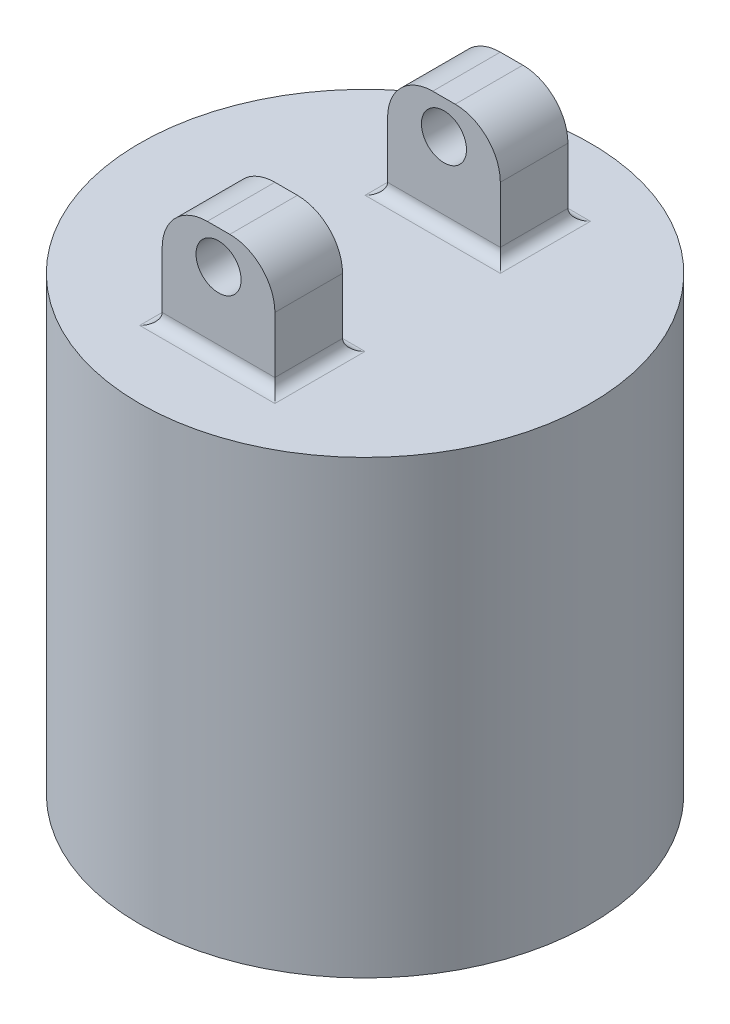
ISO-10303-21;
HEADER;
FILE_DESCRIPTION(('STEP AP214'),'2;1');
FILE_NAME('part.step','',(''),(''),'','','');
FILE_SCHEMA(('AUTOMOTIVE_DESIGN { 1 0 10303 214 1 1 1 1 }'));
ENDSEC;
DATA;
#1=APPLICATION_CONTEXT('core data for automotive mechanical design processes');
#2=APPLICATION_PROTOCOL_DEFINITION('international standard','automotive_design',2000,#1);
#3=PRODUCT_CONTEXT('',#1,'mechanical');
#4=PRODUCT('Part','Part','',(#3));
#5=PRODUCT_RELATED_PRODUCT_CATEGORY('part','',(#4));
#6=PRODUCT_DEFINITION_FORMATION('','',#4);
#7=PRODUCT_DEFINITION_CONTEXT('part definition',#1,'design');
#8=PRODUCT_DEFINITION('design','',#6,#7);
#9=PRODUCT_DEFINITION_SHAPE('','',#8);
#10=(LENGTH_UNIT() NAMED_UNIT(*) SI_UNIT(.MILLI.,.METRE.));
#11=(NAMED_UNIT(*) PLANE_ANGLE_UNIT() SI_UNIT($,.RADIAN.));
#12=(NAMED_UNIT(*) SI_UNIT($,.STERADIAN.) SOLID_ANGLE_UNIT());
#13=UNCERTAINTY_MEASURE_WITH_UNIT(LENGTH_MEASURE(1.E-05),#10,'distance_accuracy_value','');
#14=(GEOMETRIC_REPRESENTATION_CONTEXT(3) GLOBAL_UNCERTAINTY_ASSIGNED_CONTEXT((#13)) GLOBAL_UNIT_ASSIGNED_CONTEXT((#10,
#11,#12)) REPRESENTATION_CONTEXT('',''));
#15=CARTESIAN_POINT('',(0.,0.,0.));
#16=DIRECTION('',(0.,0.,1.));
#17=DIRECTION('',(1.,0.,0.));
#18=AXIS2_PLACEMENT_3D('',#15,#16,#17);
#19=CARTESIAN_POINT('',(0.,100.,0.));
#20=DIRECTION('',(0.,1.,0.));
#21=DIRECTION('',(0.,0.,1.));
#22=AXIS2_PLACEMENT_3D('',#19,#20,#21);
#23=PLANE('',#22);
#24=DIRECTION('',(0.,0.,-1.));
#25=VECTOR('',#24,1.);
#26=CARTESIAN_POINT('',(15.,100.,0.));
#27=LINE('',#26,#25);
#28=CARTESIAN_POINT('',(15.,100.,-35.));
#29=VERTEX_POINT('',#28);
#30=CARTESIAN_POINT('',(15.,100.,-15.));
#31=VERTEX_POINT('',#30);
#32=EDGE_CURVE('E231',#29,#31,#27,.F.);
#33=ORIENTED_EDGE('',*,*,#32,.T.);
#34=DIRECTION('',(1.,0.,0.));
#35=VECTOR('',#34,1.);
#36=CARTESIAN_POINT('',(0.,100.,-15.));
#37=LINE('',#36,#35);
#38=CARTESIAN_POINT('',(-15.,100.,-15.));
#39=VERTEX_POINT('',#38);
#40=EDGE_CURVE('E233',#31,#39,#37,.F.);
#41=ORIENTED_EDGE('',*,*,#40,.T.);
#42=DIRECTION('',(0.,0.,1.));
#43=VECTOR('',#42,1.);
#44=CARTESIAN_POINT('',(-15.,100.,0.));
#45=LINE('',#44,#43);
#46=CARTESIAN_POINT('',(-15.,100.,-35.));
#47=VERTEX_POINT('',#46);
#48=EDGE_CURVE('E227',#39,#47,#45,.F.);
#49=ORIENTED_EDGE('',*,*,#48,.T.);
#50=DIRECTION('',(-1.,0.,0.));
#51=VECTOR('',#50,1.);
#52=CARTESIAN_POINT('',(0.,100.,-35.));
#53=LINE('',#52,#51);
#54=EDGE_CURVE('E229',#47,#29,#53,.F.);
#55=ORIENTED_EDGE('',*,*,#54,.T.);
#56=EDGE_LOOP('',(#33,#41,#49,#55));
#57=FACE_BOUND('',#56,.T.);
#58=DIRECTION('',(0.,0.,1.));
#59=VECTOR('',#58,1.);
#60=CARTESIAN_POINT('',(-15.,100.,0.));
#61=LINE('',#60,#59);
#62=CARTESIAN_POINT('',(-15.,100.,35.));
#63=VERTEX_POINT('',#62);
#64=CARTESIAN_POINT('',(-15.,100.,15.));
#65=VERTEX_POINT('',#64);
#66=EDGE_CURVE('E194',#63,#65,#61,.F.);
#67=ORIENTED_EDGE('',*,*,#66,.T.);
#68=DIRECTION('',(-1.,0.,0.));
#69=VECTOR('',#68,1.);
#70=CARTESIAN_POINT('',(0.,100.,15.));
#71=LINE('',#70,#69);
#72=CARTESIAN_POINT('',(15.,100.,15.));
#73=VERTEX_POINT('',#72);
#74=EDGE_CURVE('E168',#65,#73,#71,.F.);
#75=ORIENTED_EDGE('',*,*,#74,.T.);
#76=DIRECTION('',(0.,0.,-1.));
#77=VECTOR('',#76,1.);
#78=CARTESIAN_POINT('',(15.,100.,0.));
#79=LINE('',#78,#77);
#80=CARTESIAN_POINT('',(15.,100.,35.));
#81=VERTEX_POINT('',#80);
#82=EDGE_CURVE('E183',#73,#81,#79,.F.);
#83=ORIENTED_EDGE('',*,*,#82,.T.);
#84=DIRECTION('',(1.,0.,0.));
#85=VECTOR('',#84,1.);
#86=CARTESIAN_POINT('',(0.,100.,35.));
#87=LINE('',#86,#85);
#88=EDGE_CURVE('E186',#81,#63,#87,.F.);
#89=ORIENTED_EDGE('',*,*,#88,.T.);
#90=EDGE_LOOP('',(#67,#75,#83,#89));
#91=FACE_BOUND('',#90,.T.);
#92=CARTESIAN_POINT('',(0.,100.,0.));
#93=DIRECTION('',(0.,1.,0.));
#94=DIRECTION('',(0.,0.,1.));
#95=AXIS2_PLACEMENT_3D('',#92,#93,#94);
#96=CIRCLE('',#95,50.);
#97=CARTESIAN_POINT('',(0.,100.,50.));
#98=VERTEX_POINT('',#97);
#99=EDGE_CURVE('E184',#98,#98,#96,.T.);
#100=ORIENTED_EDGE('',*,*,#99,.T.);
#101=EDGE_LOOP('',(#100));
#102=FACE_BOUND('',#101,.T.);
#103=ADVANCED_FACE('F32',(#57,#91,#102),#23,.T.);
#104=CARTESIAN_POINT('',(0.,100.,0.));
#105=DIRECTION('',(0.,-1.,0.));
#106=DIRECTION('',(0.,0.,-1.));
#107=AXIS2_PLACEMENT_3D('',#104,#105,#106);
#108=CYLINDRICAL_SURFACE('',#107,50.);
#109=ORIENTED_EDGE('',*,*,#99,.F.);
#110=EDGE_LOOP('',(#109));
#111=FACE_BOUND('',#110,.T.);
#112=CARTESIAN_POINT('',(0.,0.,0.));
#113=DIRECTION('',(0.,1.,0.));
#114=DIRECTION('',(0.,0.,1.));
#115=AXIS2_PLACEMENT_3D('',#112,#113,#114);
#116=CIRCLE('',#115,50.);
#117=CARTESIAN_POINT('',(0.,0.,50.));
#118=VERTEX_POINT('',#117);
#119=EDGE_CURVE('E189',#118,#118,#116,.T.);
#120=ORIENTED_EDGE('',*,*,#119,.T.);
#121=EDGE_LOOP('',(#120));
#122=FACE_BOUND('',#121,.T.);
#123=ADVANCED_FACE('F313',(#111,#122),#108,.T.);
#124=CARTESIAN_POINT('',(0.,0.,0.));
#125=DIRECTION('',(0.,1.,0.));
#126=DIRECTION('',(0.,0.,1.));
#127=AXIS2_PLACEMENT_3D('',#124,#125,#126);
#128=PLANE('',#127);
#129=ORIENTED_EDGE('',*,*,#119,.F.);
#130=EDGE_LOOP('',(#129));
#131=FACE_BOUND('',#130,.T.);
#132=ADVANCED_FACE('F315',(#131),#128,.F.);
#133=CARTESIAN_POINT('',(12.5,125.,17.5));
#134=DIRECTION('',(-1.,0.,0.));
#135=DIRECTION('',(0.,0.,1.));
#136=AXIS2_PLACEMENT_3D('',#133,#134,#135);
#137=PLANE('',#136);
#138=DIRECTION('',(0.,-1.,0.));
#139=VECTOR('',#138,1.);
#140=CARTESIAN_POINT('',(12.5,125.,17.5));
#141=LINE('',#140,#139);
#142=CARTESIAN_POINT('',(12.5,115.,17.5));
#143=VERTEX_POINT('',#142);
#144=CARTESIAN_POINT('',(12.5,102.5,17.5));
#145=VERTEX_POINT('',#144);
#146=EDGE_CURVE('E157',#143,#145,#141,.T.);
#147=ORIENTED_EDGE('',*,*,#146,.F.);
#148=DIRECTION('',(0.,0.,-1.));
#149=VECTOR('',#148,1.);
#150=CARTESIAN_POINT('',(12.5,115.,32.5));
#151=LINE('',#150,#149);
#152=CARTESIAN_POINT('',(12.5,115.,32.5));
#153=VERTEX_POINT('',#152);
#154=EDGE_CURVE('E222',#143,#153,#151,.F.);
#155=ORIENTED_EDGE('',*,*,#154,.T.);
#156=DIRECTION('',(0.,-1.,0.));
#157=VECTOR('',#156,1.);
#158=CARTESIAN_POINT('',(12.5,125.,32.5));
#159=LINE('',#158,#157);
#160=CARTESIAN_POINT('',(12.5,102.5,32.5));
#161=VERTEX_POINT('',#160);
#162=EDGE_CURVE('E307',#153,#161,#159,.T.);
#163=ORIENTED_EDGE('',*,*,#162,.T.);
#164=DIRECTION('',(0.,0.,-1.));
#165=VECTOR('',#164,1.);
#166=CARTESIAN_POINT('',(12.5,102.5,17.5));
#167=LINE('',#166,#165);
#168=EDGE_CURVE('E199',#161,#145,#167,.T.);
#169=ORIENTED_EDGE('',*,*,#168,.T.);
#170=EDGE_LOOP('',(#147,#155,#163,#169));
#171=FACE_BOUND('',#170,.T.);
#172=ADVANCED_FACE('F317',(#171),#137,.F.);
#173=CARTESIAN_POINT('',(-12.5,125.,17.5));
#174=DIRECTION('',(0.,0.,1.));
#175=DIRECTION('',(1.,0.,0.));
#176=AXIS2_PLACEMENT_3D('',#173,#174,#175);
#177=PLANE('',#176);
#178=CARTESIAN_POINT('',(0.,117.5,17.5));
#179=DIRECTION('',(0.,0.,1.));
#180=DIRECTION('',(1.,0.,0.));
#181=AXIS2_PLACEMENT_3D('',#178,#179,#180);
#182=CIRCLE('',#181,5.00000000000001);
#183=CARTESIAN_POINT('',(5.,117.5,17.5));
#184=VERTEX_POINT('',#183);
#185=EDGE_CURVE('E172',#184,#184,#182,.T.);
#186=ORIENTED_EDGE('',*,*,#185,.T.);
#187=EDGE_LOOP('',(#186));
#188=FACE_BOUND('',#187,.T.);
#189=DIRECTION('',(0.,-1.,0.));
#190=VECTOR('',#189,1.);
#191=CARTESIAN_POINT('',(-12.5,125.,17.5));
#192=LINE('',#191,#190);
#193=CARTESIAN_POINT('',(-12.5,115.,17.5));
#194=VERTEX_POINT('',#193);
#195=CARTESIAN_POINT('',(-12.5,102.5,17.5));
#196=VERTEX_POINT('',#195);
#197=EDGE_CURVE('E145',#194,#196,#192,.T.);
#198=ORIENTED_EDGE('',*,*,#197,.F.);
#199=CARTESIAN_POINT('',(-2.50000000000001,115.,17.5));
#200=DIRECTION('',(0.,0.,1.));
#201=DIRECTION('',(1.,0.,0.));
#202=AXIS2_PLACEMENT_3D('',#199,#200,#201);
#203=CIRCLE('',#202,10.);
#204=CARTESIAN_POINT('',(-2.50000000000001,125.,17.5));
#205=VERTEX_POINT('',#204);
#206=EDGE_CURVE('E220',#194,#205,#203,.F.);
#207=ORIENTED_EDGE('',*,*,#206,.T.);
#208=DIRECTION('',(-1.,0.,0.));
#209=VECTOR('',#208,1.);
#210=CARTESIAN_POINT('',(-12.5,125.,17.5));
#211=LINE('',#210,#209);
#212=CARTESIAN_POINT('',(2.49999999999999,125.,17.5));
#213=VERTEX_POINT('',#212);
#214=EDGE_CURVE('E207',#213,#205,#211,.T.);
#215=ORIENTED_EDGE('',*,*,#214,.F.);
#216=CARTESIAN_POINT('',(2.49999999999999,115.,17.5));
#217=DIRECTION('',(0.,0.,1.));
#218=DIRECTION('',(1.,0.,0.));
#219=AXIS2_PLACEMENT_3D('',#216,#217,#218);
#220=CIRCLE('',#219,10.);
#221=EDGE_CURVE('E218',#213,#143,#220,.F.);
#222=ORIENTED_EDGE('',*,*,#221,.T.);
#223=ORIENTED_EDGE('',*,*,#146,.T.);
#224=DIRECTION('',(-1.,0.,0.));
#225=VECTOR('',#224,1.);
#226=CARTESIAN_POINT('',(-12.5,102.5,17.5));
#227=LINE('',#226,#225);
#228=EDGE_CURVE('E166',#145,#196,#227,.T.);
#229=ORIENTED_EDGE('',*,*,#228,.T.);
#230=EDGE_LOOP('',(#198,#207,#215,#222,#223,#229));
#231=FACE_BOUND('',#230,.T.);
#232=ADVANCED_FACE('F180',(#188,#231),#177,.F.);
#233=CARTESIAN_POINT('',(-12.5,125.,17.5));
#234=DIRECTION('',(1.,0.,0.));
#235=DIRECTION('',(0.,0.,-1.));
#236=AXIS2_PLACEMENT_3D('',#233,#234,#235);
#237=PLANE('',#236);
#238=DIRECTION('',(0.,-1.,0.));
#239=VECTOR('',#238,1.);
#240=CARTESIAN_POINT('',(-12.5,125.,32.5));
#241=LINE('',#240,#239);
#242=CARTESIAN_POINT('',(-12.5,115.,32.5));
#243=VERTEX_POINT('',#242);
#244=CARTESIAN_POINT('',(-12.5,102.5,32.5));
#245=VERTEX_POINT('',#244);
#246=EDGE_CURVE('E158',#243,#245,#241,.T.);
#247=ORIENTED_EDGE('',*,*,#246,.F.);
#248=DIRECTION('',(0.,0.,1.));
#249=VECTOR('',#248,1.);
#250=CARTESIAN_POINT('',(-12.5,115.,17.5));
#251=LINE('',#250,#249);
#252=EDGE_CURVE('E153',#243,#194,#251,.F.);
#253=ORIENTED_EDGE('',*,*,#252,.T.);
#254=ORIENTED_EDGE('',*,*,#197,.T.);
#255=DIRECTION('',(0.,0.,1.));
#256=VECTOR('',#255,1.);
#257=CARTESIAN_POINT('',(-12.5,102.5,17.5));
#258=LINE('',#257,#256);
#259=EDGE_CURVE('E150',#196,#245,#258,.T.);
#260=ORIENTED_EDGE('',*,*,#259,.T.);
#261=EDGE_LOOP('',(#247,#253,#254,#260));
#262=FACE_BOUND('',#261,.T.);
#263=ADVANCED_FACE('F148',(#262),#237,.F.);
#264=CARTESIAN_POINT('',(-12.5,125.,32.5));
#265=DIRECTION('',(0.,0.,-1.));
#266=DIRECTION('',(-1.,0.,0.));
#267=AXIS2_PLACEMENT_3D('',#264,#265,#266);
#268=PLANE('',#267);
#269=CARTESIAN_POINT('',(0.,117.5,32.5));
#270=DIRECTION('',(0.,0.,1.));
#271=DIRECTION('',(1.,0.,0.));
#272=AXIS2_PLACEMENT_3D('',#269,#270,#271);
#273=CIRCLE('',#272,5.00000000000001);
#274=CARTESIAN_POINT('',(5.,117.5,32.5));
#275=VERTEX_POINT('',#274);
#276=EDGE_CURVE('E297',#275,#275,#273,.T.);
#277=ORIENTED_EDGE('',*,*,#276,.F.);
#278=EDGE_LOOP('',(#277));
#279=FACE_BOUND('',#278,.T.);
#280=DIRECTION('',(1.,0.,0.));
#281=VECTOR('',#280,1.);
#282=CARTESIAN_POINT('',(-12.5,125.,32.5));
#283=LINE('',#282,#281);
#284=CARTESIAN_POINT('',(-2.5,125.,32.5));
#285=VERTEX_POINT('',#284);
#286=CARTESIAN_POINT('',(2.5,125.,32.5));
#287=VERTEX_POINT('',#286);
#288=EDGE_CURVE('E304',#285,#287,#283,.T.);
#289=ORIENTED_EDGE('',*,*,#288,.F.);
#290=CARTESIAN_POINT('',(-2.5,115.,32.5));
#291=DIRECTION('',(0.,0.,-1.));
#292=DIRECTION('',(-1.,0.,0.));
#293=AXIS2_PLACEMENT_3D('',#290,#291,#292);
#294=CIRCLE('',#293,10.);
#295=EDGE_CURVE('E215',#285,#243,#294,.F.);
#296=ORIENTED_EDGE('',*,*,#295,.T.);
#297=ORIENTED_EDGE('',*,*,#246,.T.);
#298=DIRECTION('',(1.,0.,0.));
#299=VECTOR('',#298,1.);
#300=CARTESIAN_POINT('',(-12.5,102.5,32.5));
#301=LINE('',#300,#299);
#302=EDGE_CURVE('E178',#245,#161,#301,.T.);
#303=ORIENTED_EDGE('',*,*,#302,.T.);
#304=ORIENTED_EDGE('',*,*,#162,.F.);
#305=CARTESIAN_POINT('',(2.5,115.,32.5));
#306=DIRECTION('',(0.,0.,-1.));
#307=DIRECTION('',(-1.,0.,0.));
#308=AXIS2_PLACEMENT_3D('',#305,#306,#307);
#309=CIRCLE('',#308,10.);
#310=EDGE_CURVE('E213',#153,#287,#309,.F.);
#311=ORIENTED_EDGE('',*,*,#310,.T.);
#312=EDGE_LOOP('',(#289,#296,#297,#303,#304,#311));
#313=FACE_BOUND('',#312,.T.);
#314=ADVANCED_FACE('F339',(#279,#313),#268,.F.);
#315=CARTESIAN_POINT('',(0.,125.,0.));
#316=DIRECTION('',(0.,1.,0.));
#317=DIRECTION('',(0.,0.,1.));
#318=AXIS2_PLACEMENT_3D('',#315,#316,#317);
#319=PLANE('',#318);
#320=ORIENTED_EDGE('',*,*,#214,.T.);
#321=DIRECTION('',(0.,0.,1.));
#322=VECTOR('',#321,1.);
#323=CARTESIAN_POINT('',(-2.5,125.,32.5));
#324=LINE('',#323,#322);
#325=EDGE_CURVE('E210',#205,#285,#324,.T.);
#326=ORIENTED_EDGE('',*,*,#325,.T.);
#327=ORIENTED_EDGE('',*,*,#288,.T.);
#328=DIRECTION('',(0.,0.,-1.));
#329=VECTOR('',#328,1.);
#330=CARTESIAN_POINT('',(2.49999999999999,125.,17.5));
#331=LINE('',#330,#329);
#332=EDGE_CURVE('E200',#287,#213,#331,.T.);
#333=ORIENTED_EDGE('',*,*,#332,.T.);
#334=EDGE_LOOP('',(#320,#326,#327,#333));
#335=FACE_BOUND('',#334,.T.);
#336=ADVANCED_FACE('F342',(#335),#319,.T.);
#337=CARTESIAN_POINT('',(-12.5,102.5,35.));
#338=DIRECTION('',(1.,0.,0.));
#339=DIRECTION('',(0.,0.,-1.));
#340=AXIS2_PLACEMENT_3D('',#337,#338,#339);
#341=CYLINDRICAL_SURFACE('',#340,2.5);
#342=CARTESIAN_POINT('',(-15.,102.5,35.));
#343=DIRECTION('',(0.707106781186548,0.,0.707106781186547));
#344=DIRECTION('',(0.707106781186547,0.,-0.707106781186548));
#345=AXIS2_PLACEMENT_3D('',#342,#343,#344);
#346=ELLIPSE('',#345,3.53553390593274,2.5);
#347=EDGE_CURVE('E177',#63,#245,#346,.T.);
#348=ORIENTED_EDGE('',*,*,#347,.F.);
#349=ORIENTED_EDGE('',*,*,#88,.F.);
#350=CARTESIAN_POINT('',(15.,102.5,35.));
#351=DIRECTION('',(0.707106781186547,0.,-0.707106781186548));
#352=DIRECTION('',(-0.707106781186548,0.,-0.707106781186547));
#353=AXIS2_PLACEMENT_3D('',#350,#351,#352);
#354=ELLIPSE('',#353,3.53553390593274,2.5);
#355=EDGE_CURVE('E204',#161,#81,#354,.F.);
#356=ORIENTED_EDGE('',*,*,#355,.F.);
#357=ORIENTED_EDGE('',*,*,#302,.F.);
#358=EDGE_LOOP('',(#348,#349,#356,#357));
#359=FACE_BOUND('',#358,.T.);
#360=ADVANCED_FACE('F346',(#359),#341,.F.);
#361=CARTESIAN_POINT('',(15.,102.5,17.5));
#362=DIRECTION('',(0.,0.,-1.));
#363=DIRECTION('',(-1.,0.,0.));
#364=AXIS2_PLACEMENT_3D('',#361,#362,#363);
#365=CYLINDRICAL_SURFACE('',#364,2.5);
#366=ORIENTED_EDGE('',*,*,#355,.T.);
#367=ORIENTED_EDGE('',*,*,#82,.F.);
#368=CARTESIAN_POINT('',(15.,102.5,15.));
#369=DIRECTION('',(-0.707106781186548,0.,-0.707106781186547));
#370=DIRECTION('',(0.707106781186547,0.,-0.707106781186548));
#371=AXIS2_PLACEMENT_3D('',#368,#369,#370);
#372=ELLIPSE('',#371,3.53553390593274,2.5);
#373=EDGE_CURVE('E171',#145,#73,#372,.F.);
#374=ORIENTED_EDGE('',*,*,#373,.F.);
#375=ORIENTED_EDGE('',*,*,#168,.F.);
#376=EDGE_LOOP('',(#366,#367,#374,#375));
#377=FACE_BOUND('',#376,.T.);
#378=ADVANCED_FACE('F518',(#377),#365,.F.);
#379=CARTESIAN_POINT('',(-15.,102.5,17.5));
#380=DIRECTION('',(0.,0.,1.));
#381=DIRECTION('',(1.,0.,0.));
#382=AXIS2_PLACEMENT_3D('',#379,#380,#381);
#383=CYLINDRICAL_SURFACE('',#382,2.5);
#384=ORIENTED_EDGE('',*,*,#347,.T.);
#385=ORIENTED_EDGE('',*,*,#259,.F.);
#386=CARTESIAN_POINT('',(-15.,102.5,15.));
#387=DIRECTION('',(-0.707106781186547,0.,0.707106781186548));
#388=DIRECTION('',(0.707106781186548,0.,0.707106781186547));
#389=AXIS2_PLACEMENT_3D('',#386,#387,#388);
#390=ELLIPSE('',#389,3.53553390593274,2.5);
#391=EDGE_CURVE('E164',#65,#196,#390,.T.);
#392=ORIENTED_EDGE('',*,*,#391,.F.);
#393=ORIENTED_EDGE('',*,*,#66,.F.);
#394=EDGE_LOOP('',(#384,#385,#392,#393));
#395=FACE_BOUND('',#394,.T.);
#396=ADVANCED_FACE('F175',(#395),#383,.F.);
#397=CARTESIAN_POINT('',(-12.5,102.5,15.));
#398=DIRECTION('',(-1.,0.,0.));
#399=DIRECTION('',(0.,0.,1.));
#400=AXIS2_PLACEMENT_3D('',#397,#398,#399);
#401=CYLINDRICAL_SURFACE('',#400,2.5);
#402=ORIENTED_EDGE('',*,*,#373,.T.);
#403=ORIENTED_EDGE('',*,*,#74,.F.);
#404=ORIENTED_EDGE('',*,*,#391,.T.);
#405=ORIENTED_EDGE('',*,*,#228,.F.);
#406=EDGE_LOOP('',(#402,#403,#404,#405));
#407=FACE_BOUND('',#406,.T.);
#408=ADVANCED_FACE('F165',(#407),#401,.F.);
#409=CARTESIAN_POINT('',(-2.50000000000002,115.,0.));
#410=DIRECTION('',(0.,0.,-1.));
#411=DIRECTION('',(-1.,0.,0.));
#412=AXIS2_PLACEMENT_3D('',#409,#410,#411);
#413=CYLINDRICAL_SURFACE('',#412,10.);
#414=ORIENTED_EDGE('',*,*,#206,.F.);
#415=ORIENTED_EDGE('',*,*,#252,.F.);
#416=ORIENTED_EDGE('',*,*,#295,.F.);
#417=ORIENTED_EDGE('',*,*,#325,.F.);
#418=EDGE_LOOP('',(#414,#415,#416,#417));
#419=FACE_BOUND('',#418,.T.);
#420=ADVANCED_FACE('F492',(#419),#413,.T.);
#421=CARTESIAN_POINT('',(2.49999999999999,115.,0.));
#422=DIRECTION('',(0.,0.,1.));
#423=DIRECTION('',(1.,0.,0.));
#424=AXIS2_PLACEMENT_3D('',#421,#422,#423);
#425=CYLINDRICAL_SURFACE('',#424,10.);
#426=ORIENTED_EDGE('',*,*,#310,.F.);
#427=ORIENTED_EDGE('',*,*,#154,.F.);
#428=ORIENTED_EDGE('',*,*,#221,.F.);
#429=ORIENTED_EDGE('',*,*,#332,.F.);
#430=EDGE_LOOP('',(#426,#427,#428,#429));
#431=FACE_BOUND('',#430,.T.);
#432=ADVANCED_FACE('F352',(#431),#425,.T.);
#433=CARTESIAN_POINT('',(0.,117.5,7.5));
#434=DIRECTION('',(0.,0.,1.));
#435=DIRECTION('',(1.,0.,0.));
#436=AXIS2_PLACEMENT_3D('',#433,#434,#435);
#437=CYLINDRICAL_SURFACE('',#436,5.00000000000001);
#438=ORIENTED_EDGE('',*,*,#276,.T.);
#439=EDGE_LOOP('',(#438));
#440=FACE_BOUND('',#439,.T.);
#441=ORIENTED_EDGE('',*,*,#185,.F.);
#442=EDGE_LOOP('',(#441));
#443=FACE_BOUND('',#442,.T.);
#444=ADVANCED_FACE('F348',(#440,#443),#437,.F.);
#445=CARTESIAN_POINT('',(-12.5,125.,-17.5));
#446=DIRECTION('',(1.,0.,0.));
#447=DIRECTION('',(0.,0.,-1.));
#448=AXIS2_PLACEMENT_3D('',#445,#446,#447);
#449=PLANE('',#448);
#450=DIRECTION('',(0.,-1.,0.));
#451=VECTOR('',#450,1.);
#452=CARTESIAN_POINT('',(-12.5,125.,-17.5));
#453=LINE('',#452,#451);
#454=CARTESIAN_POINT('',(-12.5,115.,-17.5));
#455=VERTEX_POINT('',#454);
#456=CARTESIAN_POINT('',(-12.5,102.5,-17.5));
#457=VERTEX_POINT('',#456);
#458=EDGE_CURVE('E291',#455,#457,#453,.T.);
#459=ORIENTED_EDGE('',*,*,#458,.F.);
#460=DIRECTION('',(0.,0.,1.));
#461=VECTOR('',#460,1.);
#462=CARTESIAN_POINT('',(-12.5,115.,-32.5));
#463=LINE('',#462,#461);
#464=CARTESIAN_POINT('',(-12.5,115.,-32.5));
#465=VERTEX_POINT('',#464);
#466=EDGE_CURVE('E11',#455,#465,#463,.F.);
#467=ORIENTED_EDGE('',*,*,#466,.T.);
#468=DIRECTION('',(0.,-1.,0.));
#469=VECTOR('',#468,1.);
#470=CARTESIAN_POINT('',(-12.5,125.,-32.5));
#471=LINE('',#470,#469);
#472=CARTESIAN_POINT('',(-12.5,102.5,-32.5));
#473=VERTEX_POINT('',#472);
#474=EDGE_CURVE('E289',#465,#473,#471,.T.);
#475=ORIENTED_EDGE('',*,*,#474,.T.);
#476=DIRECTION('',(0.,0.,1.));
#477=VECTOR('',#476,1.);
#478=CARTESIAN_POINT('',(-12.5,102.5,-17.5));
#479=LINE('',#478,#477);
#480=EDGE_CURVE('E242',#473,#457,#479,.T.);
#481=ORIENTED_EDGE('',*,*,#480,.T.);
#482=EDGE_LOOP('',(#459,#467,#475,#481));
#483=FACE_BOUND('',#482,.T.);
#484=ADVANCED_FACE('F351',(#483),#449,.F.);
#485=CARTESIAN_POINT('',(12.5,125.,-17.5));
#486=DIRECTION('',(0.,0.,-1.));
#487=DIRECTION('',(-1.,0.,0.));
#488=AXIS2_PLACEMENT_3D('',#485,#486,#487);
#489=PLANE('',#488);
#490=CARTESIAN_POINT('',(0.,117.5,-17.5));
#491=DIRECTION('',(0.,0.,-1.));
#492=DIRECTION('',(-1.,0.,0.));
#493=AXIS2_PLACEMENT_3D('',#490,#491,#492);
#494=CIRCLE('',#493,5.00000000000001);
#495=CARTESIAN_POINT('',(-5.,117.5,-17.5));
#496=VERTEX_POINT('',#495);
#497=EDGE_CURVE('E250',#496,#496,#494,.T.);
#498=ORIENTED_EDGE('',*,*,#497,.T.);
#499=EDGE_LOOP('',(#498));
#500=FACE_BOUND('',#499,.T.);
#501=DIRECTION('',(0.,-1.,0.));
#502=VECTOR('',#501,1.);
#503=CARTESIAN_POINT('',(12.5,125.,-17.5));
#504=LINE('',#503,#502);
#505=CARTESIAN_POINT('',(12.5,115.,-17.5));
#506=VERTEX_POINT('',#505);
#507=CARTESIAN_POINT('',(12.5,102.5,-17.5));
#508=VERTEX_POINT('',#507);
#509=EDGE_CURVE('E272',#506,#508,#504,.T.);
#510=ORIENTED_EDGE('',*,*,#509,.F.);
#511=CARTESIAN_POINT('',(2.50000000000001,115.,-17.5));
#512=DIRECTION('',(0.,0.,-1.));
#513=DIRECTION('',(-1.,0.,0.));
#514=AXIS2_PLACEMENT_3D('',#511,#512,#513);
#515=CIRCLE('',#514,10.);
#516=CARTESIAN_POINT('',(2.50000000000001,125.,-17.5));
#517=VERTEX_POINT('',#516);
#518=EDGE_CURVE('E40',#506,#517,#515,.F.);
#519=ORIENTED_EDGE('',*,*,#518,.T.);
#520=DIRECTION('',(1.,0.,0.));
#521=VECTOR('',#520,1.);
#522=CARTESIAN_POINT('',(12.5,125.,-17.5));
#523=LINE('',#522,#521);
#524=CARTESIAN_POINT('',(-2.49999999999999,125.,-17.5));
#525=VERTEX_POINT('',#524);
#526=EDGE_CURVE('E258',#525,#517,#523,.T.);
#527=ORIENTED_EDGE('',*,*,#526,.F.);
#528=CARTESIAN_POINT('',(-2.49999999999999,115.,-17.5));
#529=DIRECTION('',(0.,0.,-1.));
#530=DIRECTION('',(-1.,0.,0.));
#531=AXIS2_PLACEMENT_3D('',#528,#529,#530);
#532=CIRCLE('',#531,10.);
#533=EDGE_CURVE('E47',#525,#455,#532,.F.);
#534=ORIENTED_EDGE('',*,*,#533,.T.);
#535=ORIENTED_EDGE('',*,*,#458,.T.);
#536=DIRECTION('',(1.,0.,0.));
#537=VECTOR('',#536,1.);
#538=CARTESIAN_POINT('',(12.5,102.5,-17.5));
#539=LINE('',#538,#537);
#540=EDGE_CURVE('E224',#457,#508,#539,.T.);
#541=ORIENTED_EDGE('',*,*,#540,.T.);
#542=EDGE_LOOP('',(#510,#519,#527,#534,#535,#541));
#543=FACE_BOUND('',#542,.T.);
#544=ADVANCED_FACE('F271',(#500,#543),#489,.F.);
#545=CARTESIAN_POINT('',(12.5,125.,-17.5));
#546=DIRECTION('',(-1.,0.,0.));
#547=DIRECTION('',(0.,0.,1.));
#548=AXIS2_PLACEMENT_3D('',#545,#546,#547);
#549=PLANE('',#548);
#550=DIRECTION('',(0.,-1.,0.));
#551=VECTOR('',#550,1.);
#552=CARTESIAN_POINT('',(12.5,125.,-32.5));
#553=LINE('',#552,#551);
#554=CARTESIAN_POINT('',(12.5,115.,-32.5));
#555=VERTEX_POINT('',#554);
#556=CARTESIAN_POINT('',(12.5,102.5,-32.5));
#557=VERTEX_POINT('',#556);
#558=EDGE_CURVE('E285',#555,#557,#553,.T.);
#559=ORIENTED_EDGE('',*,*,#558,.F.);
#560=DIRECTION('',(0.,0.,-1.));
#561=VECTOR('',#560,1.);
#562=CARTESIAN_POINT('',(12.5,115.,-17.5));
#563=LINE('',#562,#561);
#564=EDGE_CURVE('E55',#555,#506,#563,.F.);
#565=ORIENTED_EDGE('',*,*,#564,.T.);
#566=ORIENTED_EDGE('',*,*,#509,.T.);
#567=DIRECTION('',(0.,0.,-1.));
#568=VECTOR('',#567,1.);
#569=CARTESIAN_POINT('',(12.5,102.5,-17.5));
#570=LINE('',#569,#568);
#571=EDGE_CURVE('E236',#508,#557,#570,.T.);
#572=ORIENTED_EDGE('',*,*,#571,.T.);
#573=EDGE_LOOP('',(#559,#565,#566,#572));
#574=FACE_BOUND('',#573,.T.);
#575=ADVANCED_FACE('F286',(#574),#549,.F.);
#576=CARTESIAN_POINT('',(12.5,125.,-32.5));
#577=DIRECTION('',(0.,0.,1.));
#578=DIRECTION('',(1.,0.,0.));
#579=AXIS2_PLACEMENT_3D('',#576,#577,#578);
#580=PLANE('',#579);
#581=CARTESIAN_POINT('',(0.,117.5,-32.5));
#582=DIRECTION('',(0.,0.,-1.));
#583=DIRECTION('',(-1.,0.,0.));
#584=AXIS2_PLACEMENT_3D('',#581,#582,#583);
#585=CIRCLE('',#584,5.00000000000001);
#586=CARTESIAN_POINT('',(-5.,117.5,-32.5));
#587=VERTEX_POINT('',#586);
#588=EDGE_CURVE('E378',#587,#587,#585,.T.);
#589=ORIENTED_EDGE('',*,*,#588,.F.);
#590=EDGE_LOOP('',(#589));
#591=FACE_BOUND('',#590,.T.);
#592=DIRECTION('',(-1.,0.,0.));
#593=VECTOR('',#592,1.);
#594=CARTESIAN_POINT('',(12.5,125.,-32.5));
#595=LINE('',#594,#593);
#596=CARTESIAN_POINT('',(2.5,125.,-32.5));
#597=VERTEX_POINT('',#596);
#598=CARTESIAN_POINT('',(-2.5,125.,-32.5));
#599=VERTEX_POINT('',#598);
#600=EDGE_CURVE('E280',#597,#599,#595,.T.);
#601=ORIENTED_EDGE('',*,*,#600,.F.);
#602=CARTESIAN_POINT('',(2.5,115.,-32.5));
#603=DIRECTION('',(0.,0.,1.));
#604=DIRECTION('',(1.,0.,0.));
#605=AXIS2_PLACEMENT_3D('',#602,#603,#604);
#606=CIRCLE('',#605,10.);
#607=EDGE_CURVE('E266',#597,#555,#606,.F.);
#608=ORIENTED_EDGE('',*,*,#607,.T.);
#609=ORIENTED_EDGE('',*,*,#558,.T.);
#610=DIRECTION('',(-1.,0.,0.));
#611=VECTOR('',#610,1.);
#612=CARTESIAN_POINT('',(12.5,102.5,-32.5));
#613=LINE('',#612,#611);
#614=EDGE_CURVE('E239',#557,#473,#613,.T.);
#615=ORIENTED_EDGE('',*,*,#614,.T.);
#616=ORIENTED_EDGE('',*,*,#474,.F.);
#617=CARTESIAN_POINT('',(-2.5,115.,-32.5));
#618=DIRECTION('',(0.,0.,1.));
#619=DIRECTION('',(1.,0.,0.));
#620=AXIS2_PLACEMENT_3D('',#617,#618,#619);
#621=CIRCLE('',#620,10.);
#622=EDGE_CURVE('E264',#465,#599,#621,.F.);
#623=ORIENTED_EDGE('',*,*,#622,.T.);
#624=EDGE_LOOP('',(#601,#608,#609,#615,#616,#623));
#625=FACE_BOUND('',#624,.T.);
#626=ADVANCED_FACE('F284',(#591,#625),#580,.F.);
#627=CARTESIAN_POINT('',(0.,125.,0.));
#628=DIRECTION('',(0.,1.,0.));
#629=DIRECTION('',(0.,0.,-1.));
#630=AXIS2_PLACEMENT_3D('',#627,#628,#629);
#631=PLANE('',#630);
#632=ORIENTED_EDGE('',*,*,#526,.T.);
#633=DIRECTION('',(0.,0.,-1.));
#634=VECTOR('',#633,1.);
#635=CARTESIAN_POINT('',(2.5,125.,-32.5));
#636=LINE('',#635,#634);
#637=EDGE_CURVE('E261',#517,#597,#636,.T.);
#638=ORIENTED_EDGE('',*,*,#637,.T.);
#639=ORIENTED_EDGE('',*,*,#600,.T.);
#640=DIRECTION('',(0.,0.,1.));
#641=VECTOR('',#640,1.);
#642=CARTESIAN_POINT('',(-2.49999999999999,125.,-17.5));
#643=LINE('',#642,#641);
#644=EDGE_CURVE('E245',#599,#525,#643,.T.);
#645=ORIENTED_EDGE('',*,*,#644,.T.);
#646=EDGE_LOOP('',(#632,#638,#639,#645));
#647=FACE_BOUND('',#646,.T.);
#648=ADVANCED_FACE('F276',(#647),#631,.T.);
#649=CARTESIAN_POINT('',(12.5,102.5,-35.));
#650=DIRECTION('',(-1.,0.,0.));
#651=DIRECTION('',(0.,0.,1.));
#652=AXIS2_PLACEMENT_3D('',#649,#650,#651);
#653=CYLINDRICAL_SURFACE('',#652,2.5);
#654=CARTESIAN_POINT('',(15.,102.5,-35.));
#655=DIRECTION('',(-0.707106781186548,0.,-0.707106781186547));
#656=DIRECTION('',(-0.707106781186547,0.,0.707106781186548));
#657=AXIS2_PLACEMENT_3D('',#654,#655,#656);
#658=ELLIPSE('',#657,3.53553390593274,2.5);
#659=EDGE_CURVE('E252',#29,#557,#658,.T.);
#660=ORIENTED_EDGE('',*,*,#659,.F.);
#661=ORIENTED_EDGE('',*,*,#54,.F.);
#662=CARTESIAN_POINT('',(-15.,102.5,-35.));
#663=DIRECTION('',(-0.707106781186547,0.,0.707106781186548));
#664=DIRECTION('',(0.707106781186548,0.,0.707106781186547));
#665=AXIS2_PLACEMENT_3D('',#662,#663,#664);
#666=ELLIPSE('',#665,3.53553390593274,2.5);
#667=EDGE_CURVE('E255',#473,#47,#666,.F.);
#668=ORIENTED_EDGE('',*,*,#667,.F.);
#669=ORIENTED_EDGE('',*,*,#614,.F.);
#670=EDGE_LOOP('',(#660,#661,#668,#669));
#671=FACE_BOUND('',#670,.T.);
#672=ADVANCED_FACE('F367',(#671),#653,.F.);
#673=CARTESIAN_POINT('',(-15.,102.5,-17.5));
#674=DIRECTION('',(0.,0.,1.));
#675=DIRECTION('',(1.,0.,0.));
#676=AXIS2_PLACEMENT_3D('',#673,#674,#675);
#677=CYLINDRICAL_SURFACE('',#676,2.5);
#678=ORIENTED_EDGE('',*,*,#667,.T.);
#679=ORIENTED_EDGE('',*,*,#48,.F.);
#680=CARTESIAN_POINT('',(-15.,102.5,-15.));
#681=DIRECTION('',(0.707106781186548,0.,0.707106781186547));
#682=DIRECTION('',(-0.707106781186547,0.,0.707106781186548));
#683=AXIS2_PLACEMENT_3D('',#680,#681,#682);
#684=ELLIPSE('',#683,3.53553390593274,2.5);
#685=EDGE_CURVE('E249',#457,#39,#684,.F.);
#686=ORIENTED_EDGE('',*,*,#685,.F.);
#687=ORIENTED_EDGE('',*,*,#480,.F.);
#688=EDGE_LOOP('',(#678,#679,#686,#687));
#689=FACE_BOUND('',#688,.T.);
#690=ADVANCED_FACE('F394',(#689),#677,.F.);
#691=CARTESIAN_POINT('',(15.,102.5,-17.5));
#692=DIRECTION('',(0.,0.,-1.));
#693=DIRECTION('',(-1.,0.,0.));
#694=AXIS2_PLACEMENT_3D('',#691,#692,#693);
#695=CYLINDRICAL_SURFACE('',#694,2.5);
#696=ORIENTED_EDGE('',*,*,#659,.T.);
#697=ORIENTED_EDGE('',*,*,#571,.F.);
#698=CARTESIAN_POINT('',(15.,102.5,-15.));
#699=DIRECTION('',(0.707106781186547,0.,-0.707106781186548));
#700=DIRECTION('',(-0.707106781186548,0.,-0.707106781186547));
#701=AXIS2_PLACEMENT_3D('',#698,#699,#700);
#702=ELLIPSE('',#701,3.53553390593274,2.5);
#703=EDGE_CURVE('E246',#31,#508,#702,.T.);
#704=ORIENTED_EDGE('',*,*,#703,.F.);
#705=ORIENTED_EDGE('',*,*,#32,.F.);
#706=EDGE_LOOP('',(#696,#697,#704,#705));
#707=FACE_BOUND('',#706,.T.);
#708=ADVANCED_FACE('F402',(#707),#695,.F.);
#709=CARTESIAN_POINT('',(12.5,102.5,-15.));
#710=DIRECTION('',(1.,0.,0.));
#711=DIRECTION('',(0.,0.,-1.));
#712=AXIS2_PLACEMENT_3D('',#709,#710,#711);
#713=CYLINDRICAL_SURFACE('',#712,2.5);
#714=ORIENTED_EDGE('',*,*,#685,.T.);
#715=ORIENTED_EDGE('',*,*,#40,.F.);
#716=ORIENTED_EDGE('',*,*,#703,.T.);
#717=ORIENTED_EDGE('',*,*,#540,.F.);
#718=EDGE_LOOP('',(#714,#715,#716,#717));
#719=FACE_BOUND('',#718,.T.);
#720=ADVANCED_FACE('F398',(#719),#713,.F.);
#721=CARTESIAN_POINT('',(2.50000000000002,115.,0.));
#722=DIRECTION('',(0.,0.,1.));
#723=DIRECTION('',(1.,0.,0.));
#724=AXIS2_PLACEMENT_3D('',#721,#722,#723);
#725=CYLINDRICAL_SURFACE('',#724,10.);
#726=ORIENTED_EDGE('',*,*,#518,.F.);
#727=ORIENTED_EDGE('',*,*,#564,.F.);
#728=ORIENTED_EDGE('',*,*,#607,.F.);
#729=ORIENTED_EDGE('',*,*,#637,.F.);
#730=EDGE_LOOP('',(#726,#727,#728,#729));
#731=FACE_BOUND('',#730,.T.);
#732=ADVANCED_FACE('F282',(#731),#725,.T.);
#733=CARTESIAN_POINT('',(-2.49999999999999,115.,0.));
#734=DIRECTION('',(0.,0.,-1.));
#735=DIRECTION('',(-1.,0.,0.));
#736=AXIS2_PLACEMENT_3D('',#733,#734,#735);
#737=CYLINDRICAL_SURFACE('',#736,10.);
#738=ORIENTED_EDGE('',*,*,#622,.F.);
#739=ORIENTED_EDGE('',*,*,#466,.F.);
#740=ORIENTED_EDGE('',*,*,#533,.F.);
#741=ORIENTED_EDGE('',*,*,#644,.F.);
#742=EDGE_LOOP('',(#738,#739,#740,#741));
#743=FACE_BOUND('',#742,.T.);
#744=ADVANCED_FACE('F34',(#743),#737,.T.);
#745=CARTESIAN_POINT('',(0.,117.5,-7.5));
#746=DIRECTION('',(0.,0.,-1.));
#747=DIRECTION('',(-1.,0.,0.));
#748=AXIS2_PLACEMENT_3D('',#745,#746,#747);
#749=CYLINDRICAL_SURFACE('',#748,5.00000000000001);
#750=ORIENTED_EDGE('',*,*,#588,.T.);
#751=EDGE_LOOP('',(#750));
#752=FACE_BOUND('',#751,.T.);
#753=ORIENTED_EDGE('',*,*,#497,.F.);
#754=EDGE_LOOP('',(#753));
#755=FACE_BOUND('',#754,.T.);
#756=ADVANCED_FACE('F368',(#752,#755),#749,.F.);
#757=CLOSED_SHELL('',(#103,#123,#132,#172,#232,#263,#314,#336,#360,#378,#396,#408,#420,#432,
#444,#484,#544,#575,#626,#648,#672,#690,#708,#720,#732,#744,#756));
#758=MANIFOLD_SOLID_BREP('B2',#757);
#759=ADVANCED_BREP_SHAPE_REPRESENTATION('',(#18,#758),#14);
#760=SHAPE_DEFINITION_REPRESENTATION(#9,#759);
ENDSEC;
END-ISO-10303-21;
